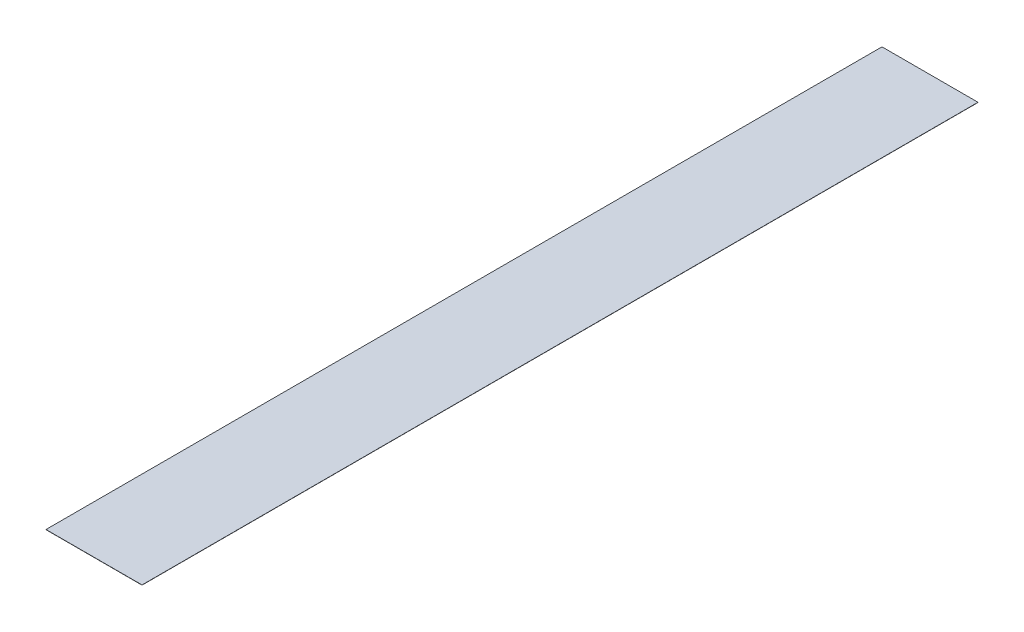
ISO-10303-21;
HEADER;
FILE_DESCRIPTION(('STEP AP214'),'2;1');
FILE_NAME('part.step','',(''),(''),'','','');
FILE_SCHEMA(('AUTOMOTIVE_DESIGN { 1 0 10303 214 1 1 1 1 }'));
ENDSEC;
DATA;
#1=APPLICATION_CONTEXT('core data for automotive mechanical design processes');
#2=APPLICATION_PROTOCOL_DEFINITION('international standard','automotive_design',2000,#1);
#3=PRODUCT_CONTEXT('',#1,'mechanical');
#4=PRODUCT('Part','Part','',(#3));
#5=PRODUCT_RELATED_PRODUCT_CATEGORY('part','',(#4));
#6=PRODUCT_DEFINITION_FORMATION('','',#4);
#7=PRODUCT_DEFINITION_CONTEXT('part definition',#1,'design');
#8=PRODUCT_DEFINITION('design','',#6,#7);
#9=PRODUCT_DEFINITION_SHAPE('','',#8);
#10=(LENGTH_UNIT() NAMED_UNIT(*) SI_UNIT(.MILLI.,.METRE.));
#11=(NAMED_UNIT(*) PLANE_ANGLE_UNIT() SI_UNIT($,.RADIAN.));
#12=(NAMED_UNIT(*) SI_UNIT($,.STERADIAN.) SOLID_ANGLE_UNIT());
#13=UNCERTAINTY_MEASURE_WITH_UNIT(LENGTH_MEASURE(1.E-05),#10,'distance_accuracy_value','');
#14=(GEOMETRIC_REPRESENTATION_CONTEXT(3) GLOBAL_UNCERTAINTY_ASSIGNED_CONTEXT((#13)) GLOBAL_UNIT_ASSIGNED_CONTEXT((#10,
#11,#12)) REPRESENTATION_CONTEXT('',''));
#15=CARTESIAN_POINT('',(0.,0.,0.));
#16=DIRECTION('',(0.,0.,1.));
#17=DIRECTION('',(1.,0.,0.));
#18=AXIS2_PLACEMENT_3D('',#15,#16,#17);
#19=CARTESIAN_POINT('',(-11.615,0.0508,101.995));
#20=DIRECTION('',(0.,0.,-1.));
#21=DIRECTION('',(-1.,0.,0.));
#22=AXIS2_PLACEMENT_3D('',#19,#20,#21);
#23=PLANE('',#22);
#24=DIRECTION('',(1.,0.,0.));
#25=VECTOR('',#24,1.);
#26=CARTESIAN_POINT('',(-11.615,0.,101.995));
#27=LINE('',#26,#25);
#28=CARTESIAN_POINT('',(-11.815,0.,101.995));
#29=VERTEX_POINT('',#28);
#30=CARTESIAN_POINT('',(11.615,0.,101.995));
#31=VERTEX_POINT('',#30);
#32=EDGE_CURVE('E60',#29,#31,#27,.T.);
#33=ORIENTED_EDGE('',*,*,#32,.T.);
#34=DIRECTION('',(0.,-1.,0.));
#35=VECTOR('',#34,1.);
#36=CARTESIAN_POINT('',(11.615,0.0508,101.995));
#37=LINE('',#36,#35);
#38=CARTESIAN_POINT('',(11.615,0.0508,101.995));
#39=VERTEX_POINT('',#38);
#40=EDGE_CURVE('E11',#39,#31,#37,.T.);
#41=ORIENTED_EDGE('',*,*,#40,.F.);
#42=DIRECTION('',(1.,0.,0.));
#43=VECTOR('',#42,1.);
#44=CARTESIAN_POINT('',(-11.615,0.0508,101.995));
#45=LINE('',#44,#43);
#46=CARTESIAN_POINT('',(-11.815,0.0508,101.995));
#47=VERTEX_POINT('',#46);
#48=EDGE_CURVE('E73',#47,#39,#45,.T.);
#49=ORIENTED_EDGE('',*,*,#48,.F.);
#50=DIRECTION('',(0.,1.,0.));
#51=VECTOR('',#50,1.);
#52=CARTESIAN_POINT('',(-11.815,0.,101.995));
#53=LINE('',#52,#51);
#54=EDGE_CURVE('E75',#29,#47,#53,.T.);
#55=ORIENTED_EDGE('',*,*,#54,.F.);
#56=EDGE_LOOP('',(#33,#41,#49,#55));
#57=FACE_BOUND('',#56,.T.);
#58=ADVANCED_FACE('F33',(#57),#23,.F.);
#59=CARTESIAN_POINT('',(11.615,0.0508,-101.995));
#60=DIRECTION('',(-1.,0.,0.));
#61=DIRECTION('',(0.,0.,1.));
#62=AXIS2_PLACEMENT_3D('',#59,#60,#61);
#63=PLANE('',#62);
#64=DIRECTION('',(0.,0.,-1.));
#65=VECTOR('',#64,1.);
#66=CARTESIAN_POINT('',(11.615,0.,-101.995));
#67=LINE('',#66,#65);
#68=CARTESIAN_POINT('',(11.615,0.,-101.995));
#69=VERTEX_POINT('',#68);
#70=EDGE_CURVE('E99',#31,#69,#67,.T.);
#71=ORIENTED_EDGE('',*,*,#70,.T.);
#72=DIRECTION('',(0.,-1.,0.));
#73=VECTOR('',#72,1.);
#74=CARTESIAN_POINT('',(11.615,0.0508,-101.995));
#75=LINE('',#74,#73);
#76=CARTESIAN_POINT('',(11.615,0.0508,-101.995));
#77=VERTEX_POINT('',#76);
#78=EDGE_CURVE('E41',#77,#69,#75,.T.);
#79=ORIENTED_EDGE('',*,*,#78,.F.);
#80=DIRECTION('',(0.,0.,-1.));
#81=VECTOR('',#80,1.);
#82=CARTESIAN_POINT('',(11.615,0.0508,-101.995));
#83=LINE('',#82,#81);
#84=EDGE_CURVE('E49',#39,#77,#83,.T.);
#85=ORIENTED_EDGE('',*,*,#84,.F.);
#86=ORIENTED_EDGE('',*,*,#40,.T.);
#87=EDGE_LOOP('',(#71,#79,#85,#86));
#88=FACE_BOUND('',#87,.T.);
#89=ADVANCED_FACE('F107',(#88),#63,.F.);
#90=CARTESIAN_POINT('',(-11.615,0.0508,-101.995));
#91=DIRECTION('',(0.,0.,1.));
#92=DIRECTION('',(1.,0.,0.));
#93=AXIS2_PLACEMENT_3D('',#90,#91,#92);
#94=PLANE('',#93);
#95=DIRECTION('',(-1.,0.,0.));
#96=VECTOR('',#95,1.);
#97=CARTESIAN_POINT('',(-11.615,0.,-101.995));
#98=LINE('',#97,#96);
#99=CARTESIAN_POINT('',(-11.815,0.,-101.995));
#100=VERTEX_POINT('',#99);
#101=EDGE_CURVE('E78',#69,#100,#98,.T.);
#102=ORIENTED_EDGE('',*,*,#101,.T.);
#103=DIRECTION('',(0.,1.,0.));
#104=VECTOR('',#103,1.);
#105=CARTESIAN_POINT('',(-11.815,0.,-101.995));
#106=LINE('',#105,#104);
#107=CARTESIAN_POINT('',(-11.815,0.0508,-101.995));
#108=VERTEX_POINT('',#107);
#109=EDGE_CURVE('E86',#100,#108,#106,.T.);
#110=ORIENTED_EDGE('',*,*,#109,.T.);
#111=DIRECTION('',(-1.,0.,0.));
#112=VECTOR('',#111,1.);
#113=CARTESIAN_POINT('',(-11.615,0.0508,-101.995));
#114=LINE('',#113,#112);
#115=EDGE_CURVE('E90',#77,#108,#114,.T.);
#116=ORIENTED_EDGE('',*,*,#115,.F.);
#117=ORIENTED_EDGE('',*,*,#78,.T.);
#118=EDGE_LOOP('',(#102,#110,#116,#117));
#119=FACE_BOUND('',#118,.T.);
#120=ADVANCED_FACE('F104',(#119),#94,.F.);
#121=CARTESIAN_POINT('',(-11.615,0.0508,101.995));
#122=DIRECTION('',(0.,1.,0.));
#123=DIRECTION('',(0.,0.,1.));
#124=AXIS2_PLACEMENT_3D('',#121,#122,#123);
#125=PLANE('',#124);
#126=ORIENTED_EDGE('',*,*,#115,.T.);
#127=DIRECTION('',(0.,0.,1.));
#128=VECTOR('',#127,1.);
#129=CARTESIAN_POINT('',(-11.815,0.0508,101.995));
#130=LINE('',#129,#128);
#131=EDGE_CURVE('E84',#108,#47,#130,.T.);
#132=ORIENTED_EDGE('',*,*,#131,.T.);
#133=ORIENTED_EDGE('',*,*,#48,.T.);
#134=ORIENTED_EDGE('',*,*,#84,.T.);
#135=EDGE_LOOP('',(#126,#132,#133,#134));
#136=FACE_BOUND('',#135,.T.);
#137=ADVANCED_FACE('F88',(#136),#125,.T.);
#138=CARTESIAN_POINT('',(-11.615,0.,101.995));
#139=DIRECTION('',(0.,1.,0.));
#140=DIRECTION('',(0.,0.,1.));
#141=AXIS2_PLACEMENT_3D('',#138,#139,#140);
#142=PLANE('',#141);
#143=ORIENTED_EDGE('',*,*,#32,.F.);
#144=DIRECTION('',(0.,0.,1.));
#145=VECTOR('',#144,1.);
#146=CARTESIAN_POINT('',(-11.815,0.,101.995));
#147=LINE('',#146,#145);
#148=EDGE_CURVE('E85',#100,#29,#147,.T.);
#149=ORIENTED_EDGE('',*,*,#148,.F.);
#150=ORIENTED_EDGE('',*,*,#101,.F.);
#151=ORIENTED_EDGE('',*,*,#70,.F.);
#152=EDGE_LOOP('',(#143,#149,#150,#151));
#153=FACE_BOUND('',#152,.T.);
#154=ADVANCED_FACE('F106',(#153),#142,.F.);
#155=CARTESIAN_POINT('',(-11.815,0.,101.995));
#156=DIRECTION('',(-1.,0.,0.));
#157=DIRECTION('',(0.,0.,1.));
#158=AXIS2_PLACEMENT_3D('',#155,#156,#157);
#159=PLANE('',#158);
#160=ORIENTED_EDGE('',*,*,#131,.F.);
#161=ORIENTED_EDGE('',*,*,#109,.F.);
#162=ORIENTED_EDGE('',*,*,#148,.T.);
#163=ORIENTED_EDGE('',*,*,#54,.T.);
#164=EDGE_LOOP('',(#160,#161,#162,#163));
#165=FACE_BOUND('',#164,.T.);
#166=ADVANCED_FACE('F82',(#165),#159,.T.);
#167=CLOSED_SHELL('',(#58,#89,#120,#137,#154,#166));
#168=MANIFOLD_SOLID_BREP('B2',#167);
#169=ADVANCED_BREP_SHAPE_REPRESENTATION('',(#18,#168),#14);
#170=SHAPE_DEFINITION_REPRESENTATION(#9,#169);
ENDSEC;
END-ISO-10303-21;
